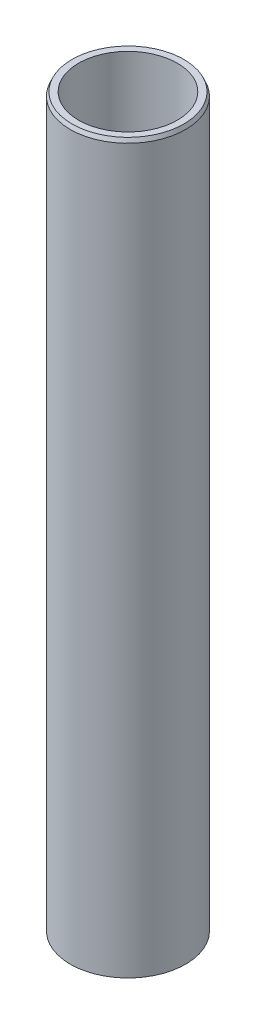
ISO-10303-21;
HEADER;
FILE_DESCRIPTION(('STEP AP214'),'2;1');
FILE_NAME('part.step','',(''),(''),'','','');
FILE_SCHEMA(('AUTOMOTIVE_DESIGN { 1 0 10303 214 1 1 1 1 }'));
ENDSEC;
DATA;
#1=APPLICATION_CONTEXT('core data for automotive mechanical design processes');
#2=APPLICATION_PROTOCOL_DEFINITION('international standard','automotive_design',2000,#1);
#3=PRODUCT_CONTEXT('',#1,'mechanical');
#4=PRODUCT('Part','Part','',(#3));
#5=PRODUCT_RELATED_PRODUCT_CATEGORY('part','',(#4));
#6=PRODUCT_DEFINITION_FORMATION('','',#4);
#7=PRODUCT_DEFINITION_CONTEXT('part definition',#1,'design');
#8=PRODUCT_DEFINITION('design','',#6,#7);
#9=PRODUCT_DEFINITION_SHAPE('','',#8);
#10=(LENGTH_UNIT() NAMED_UNIT(*) SI_UNIT(.MILLI.,.METRE.));
#11=(NAMED_UNIT(*) PLANE_ANGLE_UNIT() SI_UNIT($,.RADIAN.));
#12=(NAMED_UNIT(*) SI_UNIT($,.STERADIAN.) SOLID_ANGLE_UNIT());
#13=UNCERTAINTY_MEASURE_WITH_UNIT(LENGTH_MEASURE(1.E-05),#10,'distance_accuracy_value','');
#14=(GEOMETRIC_REPRESENTATION_CONTEXT(3) GLOBAL_UNCERTAINTY_ASSIGNED_CONTEXT((#13)) GLOBAL_UNIT_ASSIGNED_CONTEXT((#10,
#11,#12)) REPRESENTATION_CONTEXT('',''));
#15=CARTESIAN_POINT('',(0.,0.,0.));
#16=DIRECTION('',(0.,0.,1.));
#17=DIRECTION('',(1.,0.,0.));
#18=AXIS2_PLACEMENT_3D('',#15,#16,#17);
#19=CARTESIAN_POINT('',(0.,600.,0.));
#20=DIRECTION('',(0.,-1.,0.));
#21=DIRECTION('',(0.,0.,-1.));
#22=AXIS2_PLACEMENT_3D('',#19,#20,#21);
#23=CYLINDRICAL_SURFACE('',#22,47.5);
#24=CARTESIAN_POINT('',(0.,596.761122390656,0.));
#25=DIRECTION('',(0.,1.,0.));
#26=DIRECTION('',(0.,0.,1.));
#27=AXIS2_PLACEMENT_3D('',#24,#25,#26);
#28=CIRCLE('',#27,47.5);
#29=CARTESIAN_POINT('',(0.,596.761122390656,47.5));
#30=VERTEX_POINT('',#29);
#31=EDGE_CURVE('E50',#30,#30,#28,.F.);
#32=ORIENTED_EDGE('',*,*,#31,.T.);
#33=EDGE_LOOP('',(#32));
#34=FACE_BOUND('',#33,.T.);
#35=CARTESIAN_POINT('',(0.,1.42288185819262,0.));
#36=DIRECTION('',(0.,1.,0.));
#37=DIRECTION('',(0.,0.,1.));
#38=AXIS2_PLACEMENT_3D('',#35,#36,#37);
#39=CIRCLE('',#38,47.5);
#40=CARTESIAN_POINT('',(0.,1.42288185819262,47.5));
#41=VERTEX_POINT('',#40);
#42=EDGE_CURVE('E51',#41,#41,#39,.T.);
#43=ORIENTED_EDGE('',*,*,#42,.T.);
#44=EDGE_LOOP('',(#43));
#45=FACE_BOUND('',#44,.T.);
#46=ADVANCED_FACE('F39',(#34,#45),#23,.T.);
#47=CARTESIAN_POINT('',(0.,600.,0.));
#48=DIRECTION('',(0.,1.,0.));
#49=DIRECTION('',(0.,0.,1.));
#50=AXIS2_PLACEMENT_3D('',#47,#48,#49);
#51=PLANE('',#50);
#52=CARTESIAN_POINT('',(0.,600.,0.));
#53=DIRECTION('',(0.,1.,0.));
#54=DIRECTION('',(0.,0.,1.));
#55=AXIS2_PLACEMENT_3D('',#52,#53,#54);
#56=CIRCLE('',#55,46.0771181418074);
#57=CARTESIAN_POINT('',(0.,600.,46.0771181418074));
#58=VERTEX_POINT('',#57);
#59=EDGE_CURVE('E54',#58,#58,#56,.T.);
#60=ORIENTED_EDGE('',*,*,#59,.T.);
#61=EDGE_LOOP('',(#60));
#62=FACE_BOUND('',#61,.T.);
#63=CARTESIAN_POINT('',(0.,600.,0.));
#64=DIRECTION('',(0.,1.,0.));
#65=DIRECTION('',(0.,0.,1.));
#66=AXIS2_PLACEMENT_3D('',#63,#64,#65);
#67=CIRCLE('',#66,40.6858326660201);
#68=CARTESIAN_POINT('',(0.,600.,40.6858326660201));
#69=VERTEX_POINT('',#68);
#70=EDGE_CURVE('E58',#69,#69,#67,.T.);
#71=ORIENTED_EDGE('',*,*,#70,.F.);
#72=EDGE_LOOP('',(#71));
#73=FACE_BOUND('',#72,.T.);
#74=ADVANCED_FACE('F69',(#62,#73),#51,.T.);
#75=CARTESIAN_POINT('',(0.,0.,0.));
#76=DIRECTION('',(0.,1.,0.));
#77=DIRECTION('',(0.,0.,1.));
#78=AXIS2_PLACEMENT_3D('',#75,#76,#77);
#79=PLANE('',#78);
#80=CARTESIAN_POINT('',(0.,0.,0.));
#81=DIRECTION('',(0.,1.,0.));
#82=DIRECTION('',(0.,0.,1.));
#83=AXIS2_PLACEMENT_3D('',#80,#81,#82);
#84=CIRCLE('',#83,44.2611223906565);
#85=CARTESIAN_POINT('',(0.,0.,44.2611223906565));
#86=VERTEX_POINT('',#85);
#87=EDGE_CURVE('E10',#86,#86,#84,.F.);
#88=ORIENTED_EDGE('',*,*,#87,.T.);
#89=EDGE_LOOP('',(#88));
#90=FACE_BOUND('',#89,.T.);
#91=CARTESIAN_POINT('',(0.,0.,0.));
#92=DIRECTION('',(0.,1.,0.));
#93=DIRECTION('',(0.,0.,1.));
#94=AXIS2_PLACEMENT_3D('',#91,#92,#93);
#95=CIRCLE('',#94,40.6858326660201);
#96=CARTESIAN_POINT('',(0.,0.,40.6858326660201));
#97=VERTEX_POINT('',#96);
#98=EDGE_CURVE('E63',#97,#97,#95,.T.);
#99=ORIENTED_EDGE('',*,*,#98,.T.);
#100=EDGE_LOOP('',(#99));
#101=FACE_BOUND('',#100,.T.);
#102=ADVANCED_FACE('F75',(#90,#101),#79,.F.);
#103=CARTESIAN_POINT('',(0.,600.,0.));
#104=DIRECTION('',(0.,-1.,0.));
#105=DIRECTION('',(0.,0.,-1.));
#106=AXIS2_PLACEMENT_3D('',#103,#104,#105);
#107=CYLINDRICAL_SURFACE('',#106,40.6858326660201);
#108=ORIENTED_EDGE('',*,*,#70,.T.);
#109=EDGE_LOOP('',(#108));
#110=FACE_BOUND('',#109,.T.);
#111=ORIENTED_EDGE('',*,*,#98,.F.);
#112=EDGE_LOOP('',(#111));
#113=FACE_BOUND('',#112,.T.);
#114=ADVANCED_FACE('F70',(#110,#113),#107,.F.);
#115=CARTESIAN_POINT('',(0.,600.,0.));
#116=DIRECTION('',(0.,-1.,0.));
#117=DIRECTION('',(0.,0.,-1.));
#118=AXIS2_PLACEMENT_3D('',#115,#116,#117);
#119=CONICAL_SURFACE('',#118,46.0771181418074,0.413931371100991);
#120=ORIENTED_EDGE('',*,*,#31,.F.);
#121=EDGE_LOOP('',(#120));
#122=FACE_BOUND('',#121,.T.);
#123=ORIENTED_EDGE('',*,*,#59,.F.);
#124=EDGE_LOOP('',(#123));
#125=FACE_BOUND('',#124,.T.);
#126=ADVANCED_FACE('F81',(#122,#125),#119,.T.);
#127=CARTESIAN_POINT('',(0.,1.42288185819262,0.));
#128=DIRECTION('',(0.,1.,0.));
#129=DIRECTION('',(0.,0.,1.));
#130=AXIS2_PLACEMENT_3D('',#127,#128,#129);
#131=CONICAL_SURFACE('',#130,47.5,1.1568649556939);
#132=ORIENTED_EDGE('',*,*,#87,.F.);
#133=EDGE_LOOP('',(#132));
#134=FACE_BOUND('',#133,.T.);
#135=ORIENTED_EDGE('',*,*,#42,.F.);
#136=EDGE_LOOP('',(#135));
#137=FACE_BOUND('',#136,.T.);
#138=ADVANCED_FACE('F45',(#134,#137),#131,.T.);
#139=CLOSED_SHELL('',(#46,#74,#102,#114,#126,#138));
#140=MANIFOLD_SOLID_BREP('B2',#139);
#141=ADVANCED_BREP_SHAPE_REPRESENTATION('',(#18,#140),#14);
#142=SHAPE_DEFINITION_REPRESENTATION(#9,#141);
ENDSEC;
END-ISO-10303-21;
